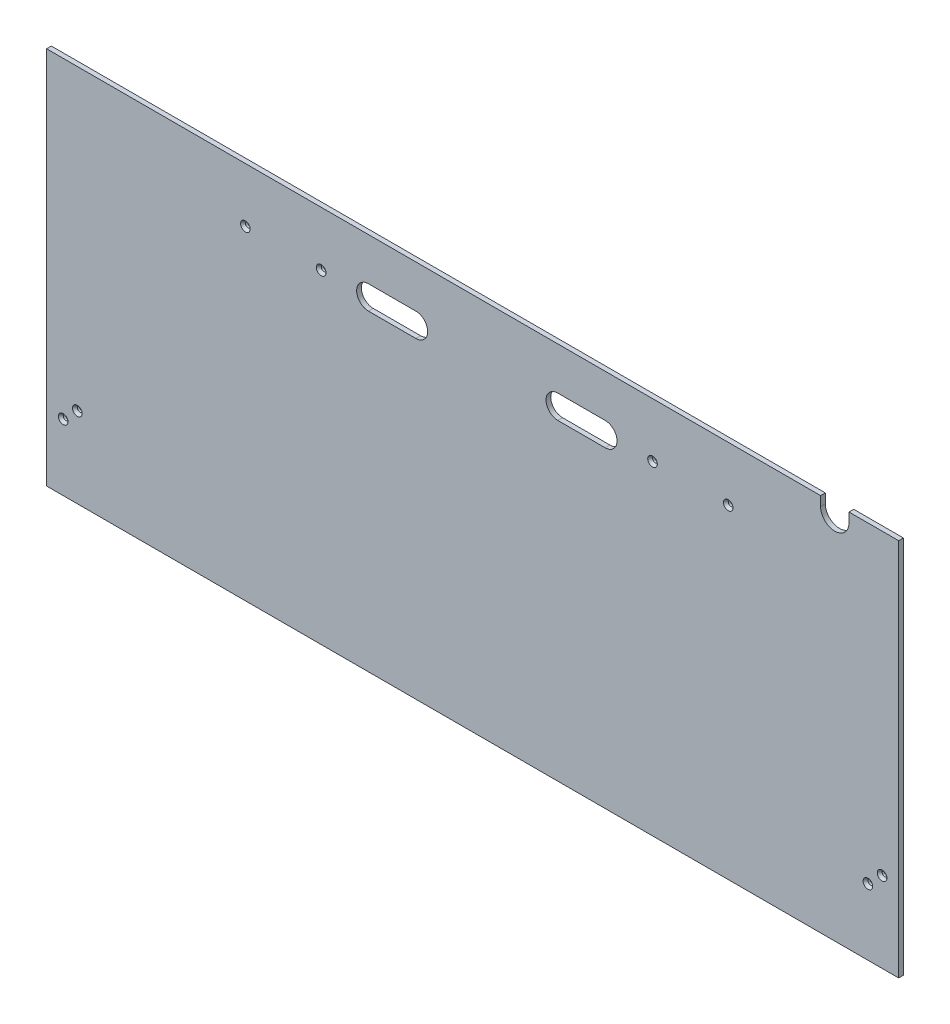
ISO-10303-21;
HEADER;
FILE_DESCRIPTION(('STEP AP214'),'2;1');
FILE_NAME('part.step','',(''),(''),'','','');
FILE_SCHEMA(('AUTOMOTIVE_DESIGN { 1 0 10303 214 1 1 1 1 }'));
ENDSEC;
DATA;
#1=APPLICATION_CONTEXT('core data for automotive mechanical design processes');
#2=APPLICATION_PROTOCOL_DEFINITION('international standard','automotive_design',2000,#1);
#3=PRODUCT_CONTEXT('',#1,'mechanical');
#4=PRODUCT('Part','Part','',(#3));
#5=PRODUCT_RELATED_PRODUCT_CATEGORY('part','',(#4));
#6=PRODUCT_DEFINITION_FORMATION('','',#4);
#7=PRODUCT_DEFINITION_CONTEXT('part definition',#1,'design');
#8=PRODUCT_DEFINITION('design','',#6,#7);
#9=PRODUCT_DEFINITION_SHAPE('','',#8);
#10=(LENGTH_UNIT() NAMED_UNIT(*) SI_UNIT(.MILLI.,.METRE.));
#11=(NAMED_UNIT(*) PLANE_ANGLE_UNIT() SI_UNIT($,.RADIAN.));
#12=(NAMED_UNIT(*) SI_UNIT($,.STERADIAN.) SOLID_ANGLE_UNIT());
#13=UNCERTAINTY_MEASURE_WITH_UNIT(LENGTH_MEASURE(1.E-05),#10,'distance_accuracy_value','');
#14=(GEOMETRIC_REPRESENTATION_CONTEXT(3) GLOBAL_UNCERTAINTY_ASSIGNED_CONTEXT((#13)) GLOBAL_UNIT_ASSIGNED_CONTEXT((#10,
#11,#12)) REPRESENTATION_CONTEXT('',''));
#15=CARTESIAN_POINT('',(0.,0.,0.));
#16=DIRECTION('',(0.,0.,1.));
#17=DIRECTION('',(1.,0.,0.));
#18=AXIS2_PLACEMENT_3D('',#15,#16,#17);
#19=CARTESIAN_POINT('',(0.,508.,6.35));
#20=DIRECTION('',(0.,-1.,0.));
#21=DIRECTION('',(0.,0.,-1.));
#22=AXIS2_PLACEMENT_3D('',#19,#20,#21);
#23=PLANE('',#22);
#24=DIRECTION('',(-1.,0.,0.));
#25=VECTOR('',#24,1.);
#26=CARTESIAN_POINT('',(0.,508.,6.35));
#27=LINE('',#26,#25);
#28=CARTESIAN_POINT('',(1038.225,508.,6.35));
#29=VERTEX_POINT('',#28);
#30=CARTESIAN_POINT('',(0.,508.,6.35));
#31=VERTEX_POINT('',#30);
#32=EDGE_CURVE('E329',#29,#31,#27,.T.);
#33=ORIENTED_EDGE('',*,*,#32,.F.);
#34=DIRECTION('',(0.,0.,1.));
#35=VECTOR('',#34,1.);
#36=CARTESIAN_POINT('',(1038.225,508.,0.));
#37=LINE('',#36,#35);
#38=CARTESIAN_POINT('',(1038.225,508.,0.));
#39=VERTEX_POINT('',#38);
#40=EDGE_CURVE('E180',#39,#29,#37,.T.);
#41=ORIENTED_EDGE('',*,*,#40,.F.);
#42=DIRECTION('',(-1.,0.,0.));
#43=VECTOR('',#42,1.);
#44=CARTESIAN_POINT('',(0.,508.,0.));
#45=LINE('',#44,#43);
#46=CARTESIAN_POINT('',(0.,508.,0.));
#47=VERTEX_POINT('',#46);
#48=EDGE_CURVE('E171',#39,#47,#45,.T.);
#49=ORIENTED_EDGE('',*,*,#48,.T.);
#50=DIRECTION('',(0.,0.,-1.));
#51=VECTOR('',#50,1.);
#52=CARTESIAN_POINT('',(0.,508.,6.35));
#53=LINE('',#52,#51);
#54=EDGE_CURVE('E333',#31,#47,#53,.T.);
#55=ORIENTED_EDGE('',*,*,#54,.F.);
#56=EDGE_LOOP('',(#33,#41,#49,#55));
#57=FACE_BOUND('',#56,.T.);
#58=ADVANCED_FACE('F37',(#57),#23,.F.);
#59=CARTESIAN_POINT('',(0.,0.,6.35));
#60=DIRECTION('',(0.,0.,-1.));
#61=DIRECTION('',(-1.,0.,0.));
#62=AXIS2_PLACEMENT_3D('',#59,#60,#61);
#63=PLANE('',#62);
#64=CARTESIAN_POINT('',(368.3,434.975,6.35));
#65=DIRECTION('',(0.,0.,1.));
#66=DIRECTION('',(1.,0.,0.));
#67=AXIS2_PLACEMENT_3D('',#64,#65,#66);
#68=CIRCLE('',#67,6.43890000000003);
#69=CARTESIAN_POINT('',(374.7389,434.975,6.35));
#70=VERTEX_POINT('',#69);
#71=EDGE_CURVE('E204',#70,#70,#68,.T.);
#72=ORIENTED_EDGE('',*,*,#71,.F.);
#73=EDGE_LOOP('',(#72));
#74=FACE_BOUND('',#73,.T.);
#75=DIRECTION('',(1.,0.,0.));
#76=VECTOR('',#75,1.);
#77=CARTESIAN_POINT('',(431.8,419.1,6.35));
#78=LINE('',#77,#76);
#79=CARTESIAN_POINT('',(431.8,419.1,6.35));
#80=VERTEX_POINT('',#79);
#81=CARTESIAN_POINT('',(495.3,419.1,6.35));
#82=VERTEX_POINT('',#81);
#83=EDGE_CURVE('E274',#80,#82,#78,.T.);
#84=ORIENTED_EDGE('',*,*,#83,.F.);
#85=CARTESIAN_POINT('',(431.8,434.975,6.35));
#86=DIRECTION('',(0.,0.,1.));
#87=DIRECTION('',(1.,0.,0.));
#88=AXIS2_PLACEMENT_3D('',#85,#86,#87);
#89=CIRCLE('',#88,15.875);
#90=CARTESIAN_POINT('',(431.8,450.85,6.35));
#91=VERTEX_POINT('',#90);
#92=EDGE_CURVE('E60',#91,#80,#89,.T.);
#93=ORIENTED_EDGE('',*,*,#92,.F.);
#94=DIRECTION('',(-1.,0.,0.));
#95=VECTOR('',#94,1.);
#96=CARTESIAN_POINT('',(431.8,450.85,6.35));
#97=LINE('',#96,#95);
#98=CARTESIAN_POINT('',(495.3,450.85,6.35));
#99=VERTEX_POINT('',#98);
#100=EDGE_CURVE('E263',#99,#91,#97,.T.);
#101=ORIENTED_EDGE('',*,*,#100,.F.);
#102=CARTESIAN_POINT('',(495.3,434.975,6.35));
#103=DIRECTION('',(0.,0.,1.));
#104=DIRECTION('',(1.,0.,0.));
#105=AXIS2_PLACEMENT_3D('',#102,#103,#104);
#106=CIRCLE('',#105,15.875);
#107=EDGE_CURVE('E278',#82,#99,#106,.T.);
#108=ORIENTED_EDGE('',*,*,#107,.F.);
#109=EDGE_LOOP('',(#84,#93,#101,#108));
#110=FACE_BOUND('',#109,.T.);
#111=DIRECTION('',(1.,0.,0.));
#112=VECTOR('',#111,1.);
#113=CARTESIAN_POINT('',(685.8,419.1,6.35));
#114=LINE('',#113,#112);
#115=CARTESIAN_POINT('',(685.8,419.1,6.35));
#116=VERTEX_POINT('',#115);
#117=CARTESIAN_POINT('',(749.3,419.1,6.35));
#118=VERTEX_POINT('',#117);
#119=EDGE_CURVE('E306',#116,#118,#114,.T.);
#120=ORIENTED_EDGE('',*,*,#119,.F.);
#121=CARTESIAN_POINT('',(685.8,434.975,6.35));
#122=DIRECTION('',(0.,0.,1.));
#123=DIRECTION('',(1.,0.,0.));
#124=AXIS2_PLACEMENT_3D('',#121,#122,#123);
#125=CIRCLE('',#124,15.875);
#126=CARTESIAN_POINT('',(685.8,450.85,6.35));
#127=VERTEX_POINT('',#126);
#128=EDGE_CURVE('E258',#127,#116,#125,.T.);
#129=ORIENTED_EDGE('',*,*,#128,.F.);
#130=DIRECTION('',(-1.,0.,0.));
#131=VECTOR('',#130,1.);
#132=CARTESIAN_POINT('',(685.8,450.85,6.35));
#133=LINE('',#132,#131);
#134=CARTESIAN_POINT('',(749.3,450.85,6.35));
#135=VERTEX_POINT('',#134);
#136=EDGE_CURVE('E295',#135,#127,#133,.T.);
#137=ORIENTED_EDGE('',*,*,#136,.F.);
#138=CARTESIAN_POINT('',(749.3,434.975,6.35));
#139=DIRECTION('',(0.,0.,1.));
#140=DIRECTION('',(1.,0.,0.));
#141=AXIS2_PLACEMENT_3D('',#138,#139,#140);
#142=CIRCLE('',#141,15.875);
#143=EDGE_CURVE('E309',#118,#135,#142,.T.);
#144=ORIENTED_EDGE('',*,*,#143,.F.);
#145=EDGE_LOOP('',(#120,#129,#137,#144));
#146=FACE_BOUND('',#145,.T.);
#147=CARTESIAN_POINT('',(1057.275,495.3,6.35));
#148=DIRECTION('',(0.,0.,1.));
#149=DIRECTION('',(-1.,0.,0.));
#150=AXIS2_PLACEMENT_3D('',#147,#148,#149);
#151=CIRCLE('',#150,19.05);
#152=CARTESIAN_POINT('',(1038.225,495.3,6.35));
#153=VERTEX_POINT('',#152);
#154=CARTESIAN_POINT('',(1076.325,495.3,6.35));
#155=VERTEX_POINT('',#154);
#156=EDGE_CURVE('E174',#153,#155,#151,.T.);
#157=ORIENTED_EDGE('',*,*,#156,.F.);
#158=DIRECTION('',(0.,-1.,0.));
#159=VECTOR('',#158,1.);
#160=CARTESIAN_POINT('',(1038.225,508.,6.35));
#161=LINE('',#160,#159);
#162=EDGE_CURVE('E156',#29,#153,#161,.T.);
#163=ORIENTED_EDGE('',*,*,#162,.F.);
#164=ORIENTED_EDGE('',*,*,#32,.T.);
#165=DIRECTION('',(0.,-1.,0.));
#166=VECTOR('',#165,1.);
#167=CARTESIAN_POINT('',(0.,0.,6.35));
#168=LINE('',#167,#166);
#169=CARTESIAN_POINT('',(0.,0.,6.35));
#170=VERTEX_POINT('',#169);
#171=EDGE_CURVE('E321',#31,#170,#168,.T.);
#172=ORIENTED_EDGE('',*,*,#171,.T.);
#173=DIRECTION('',(1.,0.,0.));
#174=VECTOR('',#173,1.);
#175=CARTESIAN_POINT('',(0.,0.,6.35));
#176=LINE('',#175,#174);
#177=CARTESIAN_POINT('',(1143.,0.,6.35));
#178=VERTEX_POINT('',#177);
#179=EDGE_CURVE('E324',#170,#178,#176,.T.);
#180=ORIENTED_EDGE('',*,*,#179,.T.);
#181=DIRECTION('',(0.,1.,0.));
#182=VECTOR('',#181,1.);
#183=CARTESIAN_POINT('',(1143.,0.,6.35));
#184=LINE('',#183,#182);
#185=CARTESIAN_POINT('',(1143.,508.,6.35));
#186=VERTEX_POINT('',#185);
#187=EDGE_CURVE('E327',#178,#186,#184,.T.);
#188=ORIENTED_EDGE('',*,*,#187,.T.);
#189=CARTESIAN_POINT('',(1076.325,508.,6.35));
#190=VERTEX_POINT('',#189);
#191=EDGE_CURVE('E330',#186,#190,#27,.T.);
#192=ORIENTED_EDGE('',*,*,#191,.T.);
#193=DIRECTION('',(0.,1.,0.));
#194=VECTOR('',#193,1.);
#195=CARTESIAN_POINT('',(1076.325,508.,6.35));
#196=LINE('',#195,#194);
#197=EDGE_CURVE('E172',#155,#190,#196,.T.);
#198=ORIENTED_EDGE('',*,*,#197,.F.);
#199=EDGE_LOOP('',(#157,#163,#164,#172,#180,#188,#192,#198));
#200=FACE_BOUND('',#199,.T.);
#201=CARTESIAN_POINT('',(22.2249999999999,88.9,6.35));
#202=DIRECTION('',(0.,0.,1.));
#203=DIRECTION('',(1.,0.,0.));
#204=AXIS2_PLACEMENT_3D('',#201,#202,#203);
#205=CIRCLE('',#204,6.4389);
#206=CARTESIAN_POINT('',(28.6638999999999,88.9,6.35));
#207=VERTEX_POINT('',#206);
#208=EDGE_CURVE('E249',#207,#207,#205,.T.);
#209=ORIENTED_EDGE('',*,*,#208,.F.);
#210=EDGE_LOOP('',(#209));
#211=FACE_BOUND('',#210,.T.);
#212=CARTESIAN_POINT('',(41.2749999999999,107.95,6.35));
#213=DIRECTION('',(0.,0.,1.));
#214=DIRECTION('',(1.,0.,0.));
#215=AXIS2_PLACEMENT_3D('',#212,#213,#214);
#216=CIRCLE('',#215,6.4389);
#217=CARTESIAN_POINT('',(47.7138999999999,107.95,6.35));
#218=VERTEX_POINT('',#217);
#219=EDGE_CURVE('E240',#218,#218,#216,.T.);
#220=ORIENTED_EDGE('',*,*,#219,.F.);
#221=EDGE_LOOP('',(#220));
#222=FACE_BOUND('',#221,.T.);
#223=CARTESIAN_POINT('',(1101.725,88.9,6.35));
#224=DIRECTION('',(0.,0.,1.));
#225=DIRECTION('',(1.,0.,0.));
#226=AXIS2_PLACEMENT_3D('',#223,#224,#225);
#227=CIRCLE('',#226,6.43890000000003);
#228=CARTESIAN_POINT('',(1108.1639,88.9,6.35));
#229=VERTEX_POINT('',#228);
#230=EDGE_CURVE('E231',#229,#229,#227,.T.);
#231=ORIENTED_EDGE('',*,*,#230,.F.);
#232=EDGE_LOOP('',(#231));
#233=FACE_BOUND('',#232,.T.);
#234=CARTESIAN_POINT('',(1120.775,107.95,6.35));
#235=DIRECTION('',(0.,0.,1.));
#236=DIRECTION('',(1.,0.,0.));
#237=AXIS2_PLACEMENT_3D('',#234,#235,#236);
#238=CIRCLE('',#237,6.43890000000003);
#239=CARTESIAN_POINT('',(1127.2139,107.95,6.35));
#240=VERTEX_POINT('',#239);
#241=EDGE_CURVE('E222',#240,#240,#238,.T.);
#242=ORIENTED_EDGE('',*,*,#241,.F.);
#243=EDGE_LOOP('',(#242));
#244=FACE_BOUND('',#243,.T.);
#245=CARTESIAN_POINT('',(266.7,434.975,6.35));
#246=DIRECTION('',(0.,0.,1.));
#247=DIRECTION('',(1.,0.,0.));
#248=AXIS2_PLACEMENT_3D('',#245,#246,#247);
#249=CIRCLE('',#248,6.43890000000003);
#250=CARTESIAN_POINT('',(273.1389,434.975,6.35));
#251=VERTEX_POINT('',#250);
#252=EDGE_CURVE('E213',#251,#251,#249,.T.);
#253=ORIENTED_EDGE('',*,*,#252,.F.);
#254=EDGE_LOOP('',(#253));
#255=FACE_BOUND('',#254,.T.);
#256=CARTESIAN_POINT('',(812.8,434.975,6.35));
#257=DIRECTION('',(0.,0.,1.));
#258=DIRECTION('',(1.,0.,0.));
#259=AXIS2_PLACEMENT_3D('',#256,#257,#258);
#260=CIRCLE('',#259,6.43890000000003);
#261=CARTESIAN_POINT('',(819.2389,434.975,6.35));
#262=VERTEX_POINT('',#261);
#263=EDGE_CURVE('E195',#262,#262,#260,.T.);
#264=ORIENTED_EDGE('',*,*,#263,.F.);
#265=EDGE_LOOP('',(#264));
#266=FACE_BOUND('',#265,.T.);
#267=CARTESIAN_POINT('',(914.4,434.975,6.35));
#268=DIRECTION('',(0.,0.,1.));
#269=DIRECTION('',(1.,0.,0.));
#270=AXIS2_PLACEMENT_3D('',#267,#268,#269);
#271=CIRCLE('',#270,6.43890000000003);
#272=CARTESIAN_POINT('',(920.8389,434.975,6.35));
#273=VERTEX_POINT('',#272);
#274=EDGE_CURVE('E182',#273,#273,#271,.T.);
#275=ORIENTED_EDGE('',*,*,#274,.F.);
#276=EDGE_LOOP('',(#275));
#277=FACE_BOUND('',#276,.T.);
#278=ADVANCED_FACE('F360',(#74,#110,#146,#200,#211,#222,#233,#244,#255,#266,#277),#63,.F.);
#279=CARTESIAN_POINT('',(0.,0.,6.35));
#280=DIRECTION('',(1.,0.,0.));
#281=DIRECTION('',(0.,0.,-1.));
#282=AXIS2_PLACEMENT_3D('',#279,#280,#281);
#283=PLANE('',#282);
#284=DIRECTION('',(0.,-1.,0.));
#285=VECTOR('',#284,1.);
#286=CARTESIAN_POINT('',(0.,0.,0.));
#287=LINE('',#286,#285);
#288=CARTESIAN_POINT('',(0.,0.,0.));
#289=VERTEX_POINT('',#288);
#290=EDGE_CURVE('E285',#47,#289,#287,.T.);
#291=ORIENTED_EDGE('',*,*,#290,.T.);
#292=DIRECTION('',(0.,0.,-1.));
#293=VECTOR('',#292,1.);
#294=CARTESIAN_POINT('',(0.,0.,6.35));
#295=LINE('',#294,#293);
#296=EDGE_CURVE('E11',#170,#289,#295,.T.);
#297=ORIENTED_EDGE('',*,*,#296,.F.);
#298=ORIENTED_EDGE('',*,*,#171,.F.);
#299=ORIENTED_EDGE('',*,*,#54,.T.);
#300=EDGE_LOOP('',(#291,#297,#298,#299));
#301=FACE_BOUND('',#300,.T.);
#302=ADVANCED_FACE('F39',(#301),#283,.F.);
#303=CARTESIAN_POINT('',(0.,0.,6.35));
#304=DIRECTION('',(0.,1.,0.));
#305=DIRECTION('',(0.,0.,1.));
#306=AXIS2_PLACEMENT_3D('',#303,#304,#305);
#307=PLANE('',#306);
#308=DIRECTION('',(1.,0.,0.));
#309=VECTOR('',#308,1.);
#310=CARTESIAN_POINT('',(0.,0.,0.));
#311=LINE('',#310,#309);
#312=CARTESIAN_POINT('',(1143.,0.,0.));
#313=VERTEX_POINT('',#312);
#314=EDGE_CURVE('E336',#289,#313,#311,.T.);
#315=ORIENTED_EDGE('',*,*,#314,.T.);
#316=DIRECTION('',(0.,0.,-1.));
#317=VECTOR('',#316,1.);
#318=CARTESIAN_POINT('',(1143.,0.,6.35));
#319=LINE('',#318,#317);
#320=EDGE_CURVE('E45',#178,#313,#319,.T.);
#321=ORIENTED_EDGE('',*,*,#320,.F.);
#322=ORIENTED_EDGE('',*,*,#179,.F.);
#323=ORIENTED_EDGE('',*,*,#296,.T.);
#324=EDGE_LOOP('',(#315,#321,#322,#323));
#325=FACE_BOUND('',#324,.T.);
#326=ADVANCED_FACE('F364',(#325),#307,.F.);
#327=CARTESIAN_POINT('',(1143.,0.,6.35));
#328=DIRECTION('',(-1.,0.,0.));
#329=DIRECTION('',(0.,0.,1.));
#330=AXIS2_PLACEMENT_3D('',#327,#328,#329);
#331=PLANE('',#330);
#332=DIRECTION('',(0.,1.,0.));
#333=VECTOR('',#332,1.);
#334=CARTESIAN_POINT('',(1143.,0.,0.));
#335=LINE('',#334,#333);
#336=CARTESIAN_POINT('',(1143.,508.,0.));
#337=VERTEX_POINT('',#336);
#338=EDGE_CURVE('E338',#313,#337,#335,.T.);
#339=ORIENTED_EDGE('',*,*,#338,.T.);
#340=DIRECTION('',(0.,0.,-1.));
#341=VECTOR('',#340,1.);
#342=CARTESIAN_POINT('',(1143.,508.,6.35));
#343=LINE('',#342,#341);
#344=EDGE_CURVE('E344',#186,#337,#343,.T.);
#345=ORIENTED_EDGE('',*,*,#344,.F.);
#346=ORIENTED_EDGE('',*,*,#187,.F.);
#347=ORIENTED_EDGE('',*,*,#320,.T.);
#348=EDGE_LOOP('',(#339,#345,#346,#347));
#349=FACE_BOUND('',#348,.T.);
#350=ADVANCED_FACE('F351',(#349),#331,.F.);
#351=CARTESIAN_POINT('',(1076.325,508.,0.));
#352=VERTEX_POINT('',#351);
#353=EDGE_CURVE('E325',#337,#352,#45,.T.);
#354=ORIENTED_EDGE('',*,*,#353,.T.);
#355=DIRECTION('',(0.,0.,1.));
#356=VECTOR('',#355,1.);
#357=CARTESIAN_POINT('',(1076.325,508.,0.));
#358=LINE('',#357,#356);
#359=EDGE_CURVE('E183',#352,#190,#358,.T.);
#360=ORIENTED_EDGE('',*,*,#359,.T.);
#361=ORIENTED_EDGE('',*,*,#191,.F.);
#362=ORIENTED_EDGE('',*,*,#344,.T.);
#363=EDGE_LOOP('',(#354,#360,#361,#362));
#364=FACE_BOUND('',#363,.T.);
#365=ADVANCED_FACE('F356',(#364),#23,.F.);
#366=CARTESIAN_POINT('',(0.,0.,0.));
#367=DIRECTION('',(0.,0.,-1.));
#368=DIRECTION('',(-1.,0.,0.));
#369=AXIS2_PLACEMENT_3D('',#366,#367,#368);
#370=PLANE('',#369);
#371=DIRECTION('',(0.,-1.,0.));
#372=VECTOR('',#371,1.);
#373=CARTESIAN_POINT('',(1038.225,508.,0.));
#374=LINE('',#373,#372);
#375=CARTESIAN_POINT('',(1038.225,495.3,0.));
#376=VERTEX_POINT('',#375);
#377=EDGE_CURVE('E153',#39,#376,#374,.T.);
#378=ORIENTED_EDGE('',*,*,#377,.T.);
#379=CARTESIAN_POINT('',(1057.275,495.3,0.));
#380=DIRECTION('',(0.,0.,1.));
#381=DIRECTION('',(-1.,0.,0.));
#382=AXIS2_PLACEMENT_3D('',#379,#380,#381);
#383=CIRCLE('',#382,19.05);
#384=CARTESIAN_POINT('',(1076.325,495.3,0.));
#385=VERTEX_POINT('',#384);
#386=EDGE_CURVE('E163',#376,#385,#383,.T.);
#387=ORIENTED_EDGE('',*,*,#386,.T.);
#388=DIRECTION('',(0.,1.,0.));
#389=VECTOR('',#388,1.);
#390=CARTESIAN_POINT('',(1076.325,508.,0.));
#391=LINE('',#390,#389);
#392=EDGE_CURVE('E52',#385,#352,#391,.T.);
#393=ORIENTED_EDGE('',*,*,#392,.T.);
#394=ORIENTED_EDGE('',*,*,#353,.F.);
#395=ORIENTED_EDGE('',*,*,#338,.F.);
#396=ORIENTED_EDGE('',*,*,#314,.F.);
#397=ORIENTED_EDGE('',*,*,#290,.F.);
#398=ORIENTED_EDGE('',*,*,#48,.F.);
#399=EDGE_LOOP('',(#378,#387,#393,#394,#395,#396,#397,#398));
#400=FACE_BOUND('',#399,.T.);
#401=CARTESIAN_POINT('',(914.4,434.975,0.));
#402=DIRECTION('',(0.,0.,-1.));
#403=DIRECTION('',(-1.,0.,0.));
#404=AXIS2_PLACEMENT_3D('',#401,#402,#403);
#405=CIRCLE('',#404,3.3782);
#406=CARTESIAN_POINT('',(911.0218,434.975,0.));
#407=VERTEX_POINT('',#406);
#408=EDGE_CURVE('E192',#407,#407,#405,.T.);
#409=ORIENTED_EDGE('',*,*,#408,.F.);
#410=EDGE_LOOP('',(#409));
#411=FACE_BOUND('',#410,.T.);
#412=CARTESIAN_POINT('',(812.8,434.975,0.));
#413=DIRECTION('',(0.,0.,-1.));
#414=DIRECTION('',(-1.,0.,0.));
#415=AXIS2_PLACEMENT_3D('',#412,#413,#414);
#416=CIRCLE('',#415,3.3782);
#417=CARTESIAN_POINT('',(809.4218,434.975,0.));
#418=VERTEX_POINT('',#417);
#419=EDGE_CURVE('E201',#418,#418,#416,.T.);
#420=ORIENTED_EDGE('',*,*,#419,.F.);
#421=EDGE_LOOP('',(#420));
#422=FACE_BOUND('',#421,.T.);
#423=CARTESIAN_POINT('',(368.3,434.975,0.));
#424=DIRECTION('',(0.,0.,-1.));
#425=DIRECTION('',(-1.,0.,0.));
#426=AXIS2_PLACEMENT_3D('',#423,#424,#425);
#427=CIRCLE('',#426,3.3782);
#428=CARTESIAN_POINT('',(364.9218,434.975,0.));
#429=VERTEX_POINT('',#428);
#430=EDGE_CURVE('E210',#429,#429,#427,.T.);
#431=ORIENTED_EDGE('',*,*,#430,.F.);
#432=EDGE_LOOP('',(#431));
#433=FACE_BOUND('',#432,.T.);
#434=CARTESIAN_POINT('',(266.7,434.975,0.));
#435=DIRECTION('',(0.,0.,-1.));
#436=DIRECTION('',(-1.,0.,0.));
#437=AXIS2_PLACEMENT_3D('',#434,#435,#436);
#438=CIRCLE('',#437,3.3782);
#439=CARTESIAN_POINT('',(263.3218,434.975,0.));
#440=VERTEX_POINT('',#439);
#441=EDGE_CURVE('E219',#440,#440,#438,.T.);
#442=ORIENTED_EDGE('',*,*,#441,.F.);
#443=EDGE_LOOP('',(#442));
#444=FACE_BOUND('',#443,.T.);
#445=CARTESIAN_POINT('',(1120.775,107.95,0.));
#446=DIRECTION('',(0.,0.,-1.));
#447=DIRECTION('',(-1.,0.,0.));
#448=AXIS2_PLACEMENT_3D('',#445,#446,#447);
#449=CIRCLE('',#448,3.3782);
#450=CARTESIAN_POINT('',(1117.3968,107.95,0.));
#451=VERTEX_POINT('',#450);
#452=EDGE_CURVE('E228',#451,#451,#449,.T.);
#453=ORIENTED_EDGE('',*,*,#452,.F.);
#454=EDGE_LOOP('',(#453));
#455=FACE_BOUND('',#454,.T.);
#456=CARTESIAN_POINT('',(1101.725,88.9,0.));
#457=DIRECTION('',(0.,0.,-1.));
#458=DIRECTION('',(-1.,0.,0.));
#459=AXIS2_PLACEMENT_3D('',#456,#457,#458);
#460=CIRCLE('',#459,3.3782);
#461=CARTESIAN_POINT('',(1098.3468,88.9,0.));
#462=VERTEX_POINT('',#461);
#463=EDGE_CURVE('E237',#462,#462,#460,.T.);
#464=ORIENTED_EDGE('',*,*,#463,.F.);
#465=EDGE_LOOP('',(#464));
#466=FACE_BOUND('',#465,.T.);
#467=CARTESIAN_POINT('',(41.2749999999999,107.95,0.));
#468=DIRECTION('',(0.,0.,-1.));
#469=DIRECTION('',(-1.,0.,0.));
#470=AXIS2_PLACEMENT_3D('',#467,#468,#469);
#471=CIRCLE('',#470,3.3782);
#472=CARTESIAN_POINT('',(37.8968,107.95,0.));
#473=VERTEX_POINT('',#472);
#474=EDGE_CURVE('E246',#473,#473,#471,.T.);
#475=ORIENTED_EDGE('',*,*,#474,.F.);
#476=EDGE_LOOP('',(#475));
#477=FACE_BOUND('',#476,.T.);
#478=CARTESIAN_POINT('',(22.2249999999999,88.9,0.));
#479=DIRECTION('',(0.,0.,-1.));
#480=DIRECTION('',(-1.,0.,0.));
#481=AXIS2_PLACEMENT_3D('',#478,#479,#480);
#482=CIRCLE('',#481,3.3782);
#483=CARTESIAN_POINT('',(18.8467999999999,88.9,0.));
#484=VERTEX_POINT('',#483);
#485=EDGE_CURVE('E255',#484,#484,#482,.T.);
#486=ORIENTED_EDGE('',*,*,#485,.F.);
#487=EDGE_LOOP('',(#486));
#488=FACE_BOUND('',#487,.T.);
#489=CARTESIAN_POINT('',(431.8,434.975,0.));
#490=DIRECTION('',(0.,0.,1.));
#491=DIRECTION('',(1.,0.,0.));
#492=AXIS2_PLACEMENT_3D('',#489,#490,#491);
#493=CIRCLE('',#492,15.875);
#494=CARTESIAN_POINT('',(431.8,450.85,0.));
#495=VERTEX_POINT('',#494);
#496=CARTESIAN_POINT('',(431.8,419.1,0.));
#497=VERTEX_POINT('',#496);
#498=EDGE_CURVE('E259',#495,#497,#493,.T.);
#499=ORIENTED_EDGE('',*,*,#498,.T.);
#500=DIRECTION('',(1.,0.,0.));
#501=VECTOR('',#500,1.);
#502=CARTESIAN_POINT('',(431.8,419.1,0.));
#503=LINE('',#502,#501);
#504=CARTESIAN_POINT('',(495.3,419.1,0.));
#505=VERTEX_POINT('',#504);
#506=EDGE_CURVE('E262',#497,#505,#503,.T.);
#507=ORIENTED_EDGE('',*,*,#506,.T.);
#508=CARTESIAN_POINT('',(495.3,434.975,0.));
#509=DIRECTION('',(0.,0.,1.));
#510=DIRECTION('',(1.,0.,0.));
#511=AXIS2_PLACEMENT_3D('',#508,#509,#510);
#512=CIRCLE('',#511,15.875);
#513=CARTESIAN_POINT('',(495.3,450.85,0.));
#514=VERTEX_POINT('',#513);
#515=EDGE_CURVE('E266',#505,#514,#512,.T.);
#516=ORIENTED_EDGE('',*,*,#515,.T.);
#517=DIRECTION('',(-1.,0.,0.));
#518=VECTOR('',#517,1.);
#519=CARTESIAN_POINT('',(431.8,450.85,0.));
#520=LINE('',#519,#518);
#521=EDGE_CURVE('E269',#514,#495,#520,.T.);
#522=ORIENTED_EDGE('',*,*,#521,.T.);
#523=EDGE_LOOP('',(#499,#507,#516,#522));
#524=FACE_BOUND('',#523,.T.);
#525=CARTESIAN_POINT('',(685.8,434.975,0.));
#526=DIRECTION('',(0.,0.,1.));
#527=DIRECTION('',(1.,0.,0.));
#528=AXIS2_PLACEMENT_3D('',#525,#526,#527);
#529=CIRCLE('',#528,15.875);
#530=CARTESIAN_POINT('',(685.8,450.85,0.));
#531=VERTEX_POINT('',#530);
#532=CARTESIAN_POINT('',(685.8,419.1,0.));
#533=VERTEX_POINT('',#532);
#534=EDGE_CURVE('E291',#531,#533,#529,.T.);
#535=ORIENTED_EDGE('',*,*,#534,.T.);
#536=DIRECTION('',(1.,0.,0.));
#537=VECTOR('',#536,1.);
#538=CARTESIAN_POINT('',(685.8,419.1,0.));
#539=LINE('',#538,#537);
#540=CARTESIAN_POINT('',(749.3,419.1,0.));
#541=VERTEX_POINT('',#540);
#542=EDGE_CURVE('E294',#533,#541,#539,.T.);
#543=ORIENTED_EDGE('',*,*,#542,.T.);
#544=CARTESIAN_POINT('',(749.3,434.975,0.));
#545=DIRECTION('',(0.,0.,1.));
#546=DIRECTION('',(1.,0.,0.));
#547=AXIS2_PLACEMENT_3D('',#544,#545,#546);
#548=CIRCLE('',#547,15.875);
#549=CARTESIAN_POINT('',(749.3,450.85,0.));
#550=VERTEX_POINT('',#549);
#551=EDGE_CURVE('E298',#541,#550,#548,.T.);
#552=ORIENTED_EDGE('',*,*,#551,.T.);
#553=DIRECTION('',(-1.,0.,0.));
#554=VECTOR('',#553,1.);
#555=CARTESIAN_POINT('',(685.8,450.85,0.));
#556=LINE('',#555,#554);
#557=EDGE_CURVE('E301',#550,#531,#556,.T.);
#558=ORIENTED_EDGE('',*,*,#557,.T.);
#559=EDGE_LOOP('',(#535,#543,#552,#558));
#560=FACE_BOUND('',#559,.T.);
#561=ADVANCED_FACE('F168',(#400,#411,#422,#433,#444,#455,#466,#477,#488,#524,#560),#370,.T.);
#562=CARTESIAN_POINT('',(685.8,434.975,0.));
#563=DIRECTION('',(0.,0.,1.));
#564=DIRECTION('',(1.,0.,0.));
#565=AXIS2_PLACEMENT_3D('',#562,#563,#564);
#566=CYLINDRICAL_SURFACE('',#565,15.875);
#567=ORIENTED_EDGE('',*,*,#128,.T.);
#568=DIRECTION('',(0.,0.,1.));
#569=VECTOR('',#568,1.);
#570=CARTESIAN_POINT('',(685.8,419.1,0.));
#571=LINE('',#570,#569);
#572=EDGE_CURVE('E304',#533,#116,#571,.T.);
#573=ORIENTED_EDGE('',*,*,#572,.F.);
#574=ORIENTED_EDGE('',*,*,#534,.F.);
#575=DIRECTION('',(0.,0.,1.));
#576=VECTOR('',#575,1.);
#577=CARTESIAN_POINT('',(685.8,450.85,0.));
#578=LINE('',#577,#576);
#579=EDGE_CURVE('E275',#531,#127,#578,.T.);
#580=ORIENTED_EDGE('',*,*,#579,.T.);
#581=EDGE_LOOP('',(#567,#573,#574,#580));
#582=FACE_BOUND('',#581,.T.);
#583=ADVANCED_FACE('F383',(#582),#566,.F.);
#584=CARTESIAN_POINT('',(685.8,450.85,0.));
#585=DIRECTION('',(0.,1.,0.));
#586=DIRECTION('',(0.,0.,1.));
#587=AXIS2_PLACEMENT_3D('',#584,#585,#586);
#588=PLANE('',#587);
#589=ORIENTED_EDGE('',*,*,#136,.T.);
#590=ORIENTED_EDGE('',*,*,#579,.F.);
#591=ORIENTED_EDGE('',*,*,#557,.F.);
#592=DIRECTION('',(0.,0.,1.));
#593=VECTOR('',#592,1.);
#594=CARTESIAN_POINT('',(749.3,450.85,0.));
#595=LINE('',#594,#593);
#596=EDGE_CURVE('E315',#550,#135,#595,.T.);
#597=ORIENTED_EDGE('',*,*,#596,.T.);
#598=EDGE_LOOP('',(#589,#590,#591,#597));
#599=FACE_BOUND('',#598,.T.);
#600=ADVANCED_FACE('F411',(#599),#588,.F.);
#601=CARTESIAN_POINT('',(749.3,434.975,0.));
#602=DIRECTION('',(0.,0.,1.));
#603=DIRECTION('',(1.,0.,0.));
#604=AXIS2_PLACEMENT_3D('',#601,#602,#603);
#605=CYLINDRICAL_SURFACE('',#604,15.875);
#606=ORIENTED_EDGE('',*,*,#143,.T.);
#607=ORIENTED_EDGE('',*,*,#596,.F.);
#608=ORIENTED_EDGE('',*,*,#551,.F.);
#609=DIRECTION('',(0.,0.,1.));
#610=VECTOR('',#609,1.);
#611=CARTESIAN_POINT('',(749.3,419.1,0.));
#612=LINE('',#611,#610);
#613=EDGE_CURVE('E317',#541,#118,#612,.T.);
#614=ORIENTED_EDGE('',*,*,#613,.T.);
#615=EDGE_LOOP('',(#606,#607,#608,#614));
#616=FACE_BOUND('',#615,.T.);
#617=ADVANCED_FACE('F419',(#616),#605,.F.);
#618=CARTESIAN_POINT('',(685.8,419.1,0.));
#619=DIRECTION('',(0.,-1.,0.));
#620=DIRECTION('',(0.,0.,-1.));
#621=AXIS2_PLACEMENT_3D('',#618,#619,#620);
#622=PLANE('',#621);
#623=ORIENTED_EDGE('',*,*,#119,.T.);
#624=ORIENTED_EDGE('',*,*,#613,.F.);
#625=ORIENTED_EDGE('',*,*,#542,.F.);
#626=ORIENTED_EDGE('',*,*,#572,.T.);
#627=EDGE_LOOP('',(#623,#624,#625,#626));
#628=FACE_BOUND('',#627,.T.);
#629=ADVANCED_FACE('F427',(#628),#622,.F.);
#630=CARTESIAN_POINT('',(431.8,434.975,0.));
#631=DIRECTION('',(0.,0.,1.));
#632=DIRECTION('',(1.,0.,0.));
#633=AXIS2_PLACEMENT_3D('',#630,#631,#632);
#634=CYLINDRICAL_SURFACE('',#633,15.875);
#635=ORIENTED_EDGE('',*,*,#92,.T.);
#636=DIRECTION('',(0.,0.,1.));
#637=VECTOR('',#636,1.);
#638=CARTESIAN_POINT('',(431.8,419.1,0.));
#639=LINE('',#638,#637);
#640=EDGE_CURVE('E272',#497,#80,#639,.T.);
#641=ORIENTED_EDGE('',*,*,#640,.F.);
#642=ORIENTED_EDGE('',*,*,#498,.F.);
#643=DIRECTION('',(0.,0.,1.));
#644=VECTOR('',#643,1.);
#645=CARTESIAN_POINT('',(431.8,450.85,0.));
#646=LINE('',#645,#644);
#647=EDGE_CURVE('E283',#495,#91,#646,.T.);
#648=ORIENTED_EDGE('',*,*,#647,.T.);
#649=EDGE_LOOP('',(#635,#641,#642,#648));
#650=FACE_BOUND('',#649,.T.);
#651=ADVANCED_FACE('F435',(#650),#634,.F.);
#652=CARTESIAN_POINT('',(431.8,450.85,0.));
#653=DIRECTION('',(0.,1.,0.));
#654=DIRECTION('',(0.,0.,1.));
#655=AXIS2_PLACEMENT_3D('',#652,#653,#654);
#656=PLANE('',#655);
#657=ORIENTED_EDGE('',*,*,#100,.T.);
#658=ORIENTED_EDGE('',*,*,#647,.F.);
#659=ORIENTED_EDGE('',*,*,#521,.F.);
#660=DIRECTION('',(0.,0.,1.));
#661=VECTOR('',#660,1.);
#662=CARTESIAN_POINT('',(495.3,450.85,0.));
#663=LINE('',#662,#661);
#664=EDGE_CURVE('E286',#514,#99,#663,.T.);
#665=ORIENTED_EDGE('',*,*,#664,.T.);
#666=EDGE_LOOP('',(#657,#658,#659,#665));
#667=FACE_BOUND('',#666,.T.);
#668=ADVANCED_FACE('F443',(#667),#656,.F.);
#669=CARTESIAN_POINT('',(495.3,434.975,0.));
#670=DIRECTION('',(0.,0.,1.));
#671=DIRECTION('',(1.,0.,0.));
#672=AXIS2_PLACEMENT_3D('',#669,#670,#671);
#673=CYLINDRICAL_SURFACE('',#672,15.875);
#674=ORIENTED_EDGE('',*,*,#107,.T.);
#675=ORIENTED_EDGE('',*,*,#664,.F.);
#676=ORIENTED_EDGE('',*,*,#515,.F.);
#677=DIRECTION('',(0.,0.,1.));
#678=VECTOR('',#677,1.);
#679=CARTESIAN_POINT('',(495.3,419.1,0.));
#680=LINE('',#679,#678);
#681=EDGE_CURVE('E288',#505,#82,#680,.T.);
#682=ORIENTED_EDGE('',*,*,#681,.T.);
#683=EDGE_LOOP('',(#674,#675,#676,#682));
#684=FACE_BOUND('',#683,.T.);
#685=ADVANCED_FACE('F450',(#684),#673,.F.);
#686=CARTESIAN_POINT('',(431.8,419.1,0.));
#687=DIRECTION('',(0.,-1.,0.));
#688=DIRECTION('',(0.,0.,-1.));
#689=AXIS2_PLACEMENT_3D('',#686,#687,#688);
#690=PLANE('',#689);
#691=ORIENTED_EDGE('',*,*,#83,.T.);
#692=ORIENTED_EDGE('',*,*,#681,.F.);
#693=ORIENTED_EDGE('',*,*,#506,.F.);
#694=ORIENTED_EDGE('',*,*,#640,.T.);
#695=EDGE_LOOP('',(#691,#692,#693,#694));
#696=FACE_BOUND('',#695,.T.);
#697=ADVANCED_FACE('F458',(#696),#690,.F.);
#698=CARTESIAN_POINT('',(22.2249999999999,88.9,6.35));
#699=DIRECTION('',(0.,0.,1.));
#700=DIRECTION('',(1.,0.,0.));
#701=AXIS2_PLACEMENT_3D('',#698,#699,#700);
#702=CYLINDRICAL_SURFACE('',#701,3.3782);
#703=CARTESIAN_POINT('',(22.2249999999999,88.9,2.82906741601866));
#704=DIRECTION('',(0.,0.,1.));
#705=DIRECTION('',(1.,0.,0.));
#706=AXIS2_PLACEMENT_3D('',#703,#704,#705);
#707=CIRCLE('',#706,3.3782);
#708=CARTESIAN_POINT('',(25.6031999999999,88.9,2.82906741601866));
#709=VERTEX_POINT('',#708);
#710=EDGE_CURVE('E252',#709,#709,#707,.T.);
#711=ORIENTED_EDGE('',*,*,#710,.T.);
#712=EDGE_LOOP('',(#711));
#713=FACE_BOUND('',#712,.T.);
#714=ORIENTED_EDGE('',*,*,#485,.T.);
#715=EDGE_LOOP('',(#714));
#716=FACE_BOUND('',#715,.T.);
#717=ADVANCED_FACE('F466',(#713,#716),#702,.F.);
#718=CARTESIAN_POINT('',(22.2249999999999,88.9,6.35));
#719=DIRECTION('',(0.,0.,1.));
#720=DIRECTION('',(1.,0.,0.));
#721=AXIS2_PLACEMENT_3D('',#718,#719,#720);
#722=CONICAL_SURFACE('',#721,6.4389,0.715584993317677);
#723=ORIENTED_EDGE('',*,*,#710,.F.);
#724=EDGE_LOOP('',(#723));
#725=FACE_BOUND('',#724,.T.);
#726=ORIENTED_EDGE('',*,*,#208,.T.);
#727=EDGE_LOOP('',(#726));
#728=FACE_BOUND('',#727,.T.);
#729=ADVANCED_FACE('F478',(#725,#728),#722,.F.);
#730=CARTESIAN_POINT('',(41.2749999999999,107.95,6.35));
#731=DIRECTION('',(0.,0.,1.));
#732=DIRECTION('',(1.,0.,0.));
#733=AXIS2_PLACEMENT_3D('',#730,#731,#732);
#734=CYLINDRICAL_SURFACE('',#733,3.3782);
#735=CARTESIAN_POINT('',(41.2749999999999,107.95,2.82906741601866));
#736=DIRECTION('',(0.,0.,1.));
#737=DIRECTION('',(1.,0.,0.));
#738=AXIS2_PLACEMENT_3D('',#735,#736,#737);
#739=CIRCLE('',#738,3.3782);
#740=CARTESIAN_POINT('',(44.6531999999999,107.95,2.82906741601866));
#741=VERTEX_POINT('',#740);
#742=EDGE_CURVE('E243',#741,#741,#739,.T.);
#743=ORIENTED_EDGE('',*,*,#742,.T.);
#744=EDGE_LOOP('',(#743));
#745=FACE_BOUND('',#744,.T.);
#746=ORIENTED_EDGE('',*,*,#474,.T.);
#747=EDGE_LOOP('',(#746));
#748=FACE_BOUND('',#747,.T.);
#749=ADVANCED_FACE('F486',(#745,#748),#734,.F.);
#750=CARTESIAN_POINT('',(41.2749999999999,107.95,6.35));
#751=DIRECTION('',(0.,0.,1.));
#752=DIRECTION('',(1.,0.,0.));
#753=AXIS2_PLACEMENT_3D('',#750,#751,#752);
#754=CONICAL_SURFACE('',#753,6.4389,0.715584993317676);
#755=ORIENTED_EDGE('',*,*,#742,.F.);
#756=EDGE_LOOP('',(#755));
#757=FACE_BOUND('',#756,.T.);
#758=ORIENTED_EDGE('',*,*,#219,.T.);
#759=EDGE_LOOP('',(#758));
#760=FACE_BOUND('',#759,.T.);
#761=ADVANCED_FACE('F494',(#757,#760),#754,.F.);
#762=CARTESIAN_POINT('',(1101.725,88.9,6.35));
#763=DIRECTION('',(0.,0.,1.));
#764=DIRECTION('',(1.,0.,0.));
#765=AXIS2_PLACEMENT_3D('',#762,#763,#764);
#766=CYLINDRICAL_SURFACE('',#765,3.3782);
#767=CARTESIAN_POINT('',(1101.725,88.9,2.82906741601866));
#768=DIRECTION('',(0.,0.,1.));
#769=DIRECTION('',(1.,0.,0.));
#770=AXIS2_PLACEMENT_3D('',#767,#768,#769);
#771=CIRCLE('',#770,3.3782);
#772=CARTESIAN_POINT('',(1105.1032,88.9,2.82906741601866));
#773=VERTEX_POINT('',#772);
#774=EDGE_CURVE('E234',#773,#773,#771,.T.);
#775=ORIENTED_EDGE('',*,*,#774,.T.);
#776=EDGE_LOOP('',(#775));
#777=FACE_BOUND('',#776,.T.);
#778=ORIENTED_EDGE('',*,*,#463,.T.);
#779=EDGE_LOOP('',(#778));
#780=FACE_BOUND('',#779,.T.);
#781=ADVANCED_FACE('F502',(#777,#780),#766,.F.);
#782=CARTESIAN_POINT('',(1101.725,88.9,6.35));
#783=DIRECTION('',(0.,0.,1.));
#784=DIRECTION('',(1.,0.,0.));
#785=AXIS2_PLACEMENT_3D('',#782,#783,#784);
#786=CONICAL_SURFACE('',#785,6.43890000000003,0.715584993317681);
#787=ORIENTED_EDGE('',*,*,#774,.F.);
#788=EDGE_LOOP('',(#787));
#789=FACE_BOUND('',#788,.T.);
#790=ORIENTED_EDGE('',*,*,#230,.T.);
#791=EDGE_LOOP('',(#790));
#792=FACE_BOUND('',#791,.T.);
#793=ADVANCED_FACE('F510',(#789,#792),#786,.F.);
#794=CARTESIAN_POINT('',(1120.775,107.95,6.35));
#795=DIRECTION('',(0.,0.,1.));
#796=DIRECTION('',(1.,0.,0.));
#797=AXIS2_PLACEMENT_3D('',#794,#795,#796);
#798=CYLINDRICAL_SURFACE('',#797,3.3782);
#799=CARTESIAN_POINT('',(1120.775,107.95,2.82906741601866));
#800=DIRECTION('',(0.,0.,1.));
#801=DIRECTION('',(1.,0.,0.));
#802=AXIS2_PLACEMENT_3D('',#799,#800,#801);
#803=CIRCLE('',#802,3.3782);
#804=CARTESIAN_POINT('',(1124.1532,107.95,2.82906741601866));
#805=VERTEX_POINT('',#804);
#806=EDGE_CURVE('E225',#805,#805,#803,.T.);
#807=ORIENTED_EDGE('',*,*,#806,.T.);
#808=EDGE_LOOP('',(#807));
#809=FACE_BOUND('',#808,.T.);
#810=ORIENTED_EDGE('',*,*,#452,.T.);
#811=EDGE_LOOP('',(#810));
#812=FACE_BOUND('',#811,.T.);
#813=ADVANCED_FACE('F518',(#809,#812),#798,.F.);
#814=CARTESIAN_POINT('',(1120.775,107.95,6.35));
#815=DIRECTION('',(0.,0.,1.));
#816=DIRECTION('',(1.,0.,0.));
#817=AXIS2_PLACEMENT_3D('',#814,#815,#816);
#818=CONICAL_SURFACE('',#817,6.43890000000003,0.715584993317681);
#819=ORIENTED_EDGE('',*,*,#806,.F.);
#820=EDGE_LOOP('',(#819));
#821=FACE_BOUND('',#820,.T.);
#822=ORIENTED_EDGE('',*,*,#241,.T.);
#823=EDGE_LOOP('',(#822));
#824=FACE_BOUND('',#823,.T.);
#825=ADVANCED_FACE('F526',(#821,#824),#818,.F.);
#826=CARTESIAN_POINT('',(266.7,434.975,6.35));
#827=DIRECTION('',(0.,0.,1.));
#828=DIRECTION('',(1.,0.,0.));
#829=AXIS2_PLACEMENT_3D('',#826,#827,#828);
#830=CYLINDRICAL_SURFACE('',#829,3.3782);
#831=CARTESIAN_POINT('',(266.7,434.975,2.82906741601866));
#832=DIRECTION('',(0.,0.,1.));
#833=DIRECTION('',(1.,0.,0.));
#834=AXIS2_PLACEMENT_3D('',#831,#832,#833);
#835=CIRCLE('',#834,3.3782);
#836=CARTESIAN_POINT('',(270.0782,434.975,2.82906741601866));
#837=VERTEX_POINT('',#836);
#838=EDGE_CURVE('E216',#837,#837,#835,.T.);
#839=ORIENTED_EDGE('',*,*,#838,.T.);
#840=EDGE_LOOP('',(#839));
#841=FACE_BOUND('',#840,.T.);
#842=ORIENTED_EDGE('',*,*,#441,.T.);
#843=EDGE_LOOP('',(#842));
#844=FACE_BOUND('',#843,.T.);
#845=ADVANCED_FACE('F534',(#841,#844),#830,.F.);
#846=CARTESIAN_POINT('',(266.7,434.975,6.35));
#847=DIRECTION('',(0.,0.,1.));
#848=DIRECTION('',(1.,0.,0.));
#849=AXIS2_PLACEMENT_3D('',#846,#847,#848);
#850=CONICAL_SURFACE('',#849,6.43890000000003,0.715584993317681);
#851=ORIENTED_EDGE('',*,*,#838,.F.);
#852=EDGE_LOOP('',(#851));
#853=FACE_BOUND('',#852,.T.);
#854=ORIENTED_EDGE('',*,*,#252,.T.);
#855=EDGE_LOOP('',(#854));
#856=FACE_BOUND('',#855,.T.);
#857=ADVANCED_FACE('F542',(#853,#856),#850,.F.);
#858=CARTESIAN_POINT('',(368.3,434.975,6.35));
#859=DIRECTION('',(0.,0.,1.));
#860=DIRECTION('',(1.,0.,0.));
#861=AXIS2_PLACEMENT_3D('',#858,#859,#860);
#862=CYLINDRICAL_SURFACE('',#861,3.3782);
#863=CARTESIAN_POINT('',(368.3,434.975,2.82906741601866));
#864=DIRECTION('',(0.,0.,1.));
#865=DIRECTION('',(1.,0.,0.));
#866=AXIS2_PLACEMENT_3D('',#863,#864,#865);
#867=CIRCLE('',#866,3.3782);
#868=CARTESIAN_POINT('',(371.6782,434.975,2.82906741601866));
#869=VERTEX_POINT('',#868);
#870=EDGE_CURVE('E207',#869,#869,#867,.T.);
#871=ORIENTED_EDGE('',*,*,#870,.T.);
#872=EDGE_LOOP('',(#871));
#873=FACE_BOUND('',#872,.T.);
#874=ORIENTED_EDGE('',*,*,#430,.T.);
#875=EDGE_LOOP('',(#874));
#876=FACE_BOUND('',#875,.T.);
#877=ADVANCED_FACE('F550',(#873,#876),#862,.F.);
#878=CARTESIAN_POINT('',(368.3,434.975,6.35));
#879=DIRECTION('',(0.,0.,1.));
#880=DIRECTION('',(1.,0.,0.));
#881=AXIS2_PLACEMENT_3D('',#878,#879,#880);
#882=CONICAL_SURFACE('',#881,6.43890000000003,0.715584993317681);
#883=ORIENTED_EDGE('',*,*,#870,.F.);
#884=EDGE_LOOP('',(#883));
#885=FACE_BOUND('',#884,.T.);
#886=ORIENTED_EDGE('',*,*,#71,.T.);
#887=EDGE_LOOP('',(#886));
#888=FACE_BOUND('',#887,.T.);
#889=ADVANCED_FACE('F558',(#885,#888),#882,.F.);
#890=CARTESIAN_POINT('',(812.8,434.975,6.35));
#891=DIRECTION('',(0.,0.,1.));
#892=DIRECTION('',(1.,0.,0.));
#893=AXIS2_PLACEMENT_3D('',#890,#891,#892);
#894=CYLINDRICAL_SURFACE('',#893,3.3782);
#895=CARTESIAN_POINT('',(812.8,434.975,2.82906741601866));
#896=DIRECTION('',(0.,0.,1.));
#897=DIRECTION('',(1.,0.,0.));
#898=AXIS2_PLACEMENT_3D('',#895,#896,#897);
#899=CIRCLE('',#898,3.3782);
#900=CARTESIAN_POINT('',(816.1782,434.975,2.82906741601866));
#901=VERTEX_POINT('',#900);
#902=EDGE_CURVE('E198',#901,#901,#899,.T.);
#903=ORIENTED_EDGE('',*,*,#902,.T.);
#904=EDGE_LOOP('',(#903));
#905=FACE_BOUND('',#904,.T.);
#906=ORIENTED_EDGE('',*,*,#419,.T.);
#907=EDGE_LOOP('',(#906));
#908=FACE_BOUND('',#907,.T.);
#909=ADVANCED_FACE('F566',(#905,#908),#894,.F.);
#910=CARTESIAN_POINT('',(812.8,434.975,6.35));
#911=DIRECTION('',(0.,0.,1.));
#912=DIRECTION('',(1.,0.,0.));
#913=AXIS2_PLACEMENT_3D('',#910,#911,#912);
#914=CONICAL_SURFACE('',#913,6.43890000000003,0.715584993317681);
#915=ORIENTED_EDGE('',*,*,#902,.F.);
#916=EDGE_LOOP('',(#915));
#917=FACE_BOUND('',#916,.T.);
#918=ORIENTED_EDGE('',*,*,#263,.T.);
#919=EDGE_LOOP('',(#918));
#920=FACE_BOUND('',#919,.T.);
#921=ADVANCED_FACE('F574',(#917,#920),#914,.F.);
#922=CARTESIAN_POINT('',(914.4,434.975,6.35));
#923=DIRECTION('',(0.,0.,1.));
#924=DIRECTION('',(1.,0.,0.));
#925=AXIS2_PLACEMENT_3D('',#922,#923,#924);
#926=CYLINDRICAL_SURFACE('',#925,3.3782);
#927=CARTESIAN_POINT('',(914.4,434.975,2.82906741601866));
#928=DIRECTION('',(0.,0.,1.));
#929=DIRECTION('',(1.,0.,0.));
#930=AXIS2_PLACEMENT_3D('',#927,#928,#929);
#931=CIRCLE('',#930,3.3782);
#932=CARTESIAN_POINT('',(917.7782,434.975,2.82906741601866));
#933=VERTEX_POINT('',#932);
#934=EDGE_CURVE('E189',#933,#933,#931,.T.);
#935=ORIENTED_EDGE('',*,*,#934,.T.);
#936=EDGE_LOOP('',(#935));
#937=FACE_BOUND('',#936,.T.);
#938=ORIENTED_EDGE('',*,*,#408,.T.);
#939=EDGE_LOOP('',(#938));
#940=FACE_BOUND('',#939,.T.);
#941=ADVANCED_FACE('F582',(#937,#940),#926,.F.);
#942=CARTESIAN_POINT('',(914.4,434.975,6.35));
#943=DIRECTION('',(0.,0.,1.));
#944=DIRECTION('',(1.,0.,0.));
#945=AXIS2_PLACEMENT_3D('',#942,#943,#944);
#946=CONICAL_SURFACE('',#945,6.43890000000003,0.715584993317681);
#947=ORIENTED_EDGE('',*,*,#934,.F.);
#948=EDGE_LOOP('',(#947));
#949=FACE_BOUND('',#948,.T.);
#950=ORIENTED_EDGE('',*,*,#274,.T.);
#951=EDGE_LOOP('',(#950));
#952=FACE_BOUND('',#951,.T.);
#953=ADVANCED_FACE('F590',(#949,#952),#946,.F.);
#954=CARTESIAN_POINT('',(1038.225,508.,0.));
#955=DIRECTION('',(-1.,0.,0.));
#956=DIRECTION('',(0.,0.,1.));
#957=AXIS2_PLACEMENT_3D('',#954,#955,#956);
#958=PLANE('',#957);
#959=ORIENTED_EDGE('',*,*,#162,.T.);
#960=DIRECTION('',(0.,0.,1.));
#961=VECTOR('',#960,1.);
#962=CARTESIAN_POINT('',(1038.225,495.3,0.));
#963=LINE('',#962,#961);
#964=EDGE_CURVE('E149',#376,#153,#963,.T.);
#965=ORIENTED_EDGE('',*,*,#964,.F.);
#966=ORIENTED_EDGE('',*,*,#377,.F.);
#967=ORIENTED_EDGE('',*,*,#40,.T.);
#968=EDGE_LOOP('',(#959,#965,#966,#967));
#969=FACE_BOUND('',#968,.T.);
#970=ADVANCED_FACE('F151',(#969),#958,.F.);
#971=CARTESIAN_POINT('',(1076.325,508.,0.));
#972=DIRECTION('',(1.,0.,0.));
#973=DIRECTION('',(0.,0.,-1.));
#974=AXIS2_PLACEMENT_3D('',#971,#972,#973);
#975=PLANE('',#974);
#976=ORIENTED_EDGE('',*,*,#197,.T.);
#977=ORIENTED_EDGE('',*,*,#359,.F.);
#978=ORIENTED_EDGE('',*,*,#392,.F.);
#979=DIRECTION('',(0.,0.,1.));
#980=VECTOR('',#979,1.);
#981=CARTESIAN_POINT('',(1076.325,495.3,0.));
#982=LINE('',#981,#980);
#983=EDGE_CURVE('E160',#385,#155,#982,.T.);
#984=ORIENTED_EDGE('',*,*,#983,.T.);
#985=EDGE_LOOP('',(#976,#977,#978,#984));
#986=FACE_BOUND('',#985,.T.);
#987=ADVANCED_FACE('F605',(#986),#975,.F.);
#988=CARTESIAN_POINT('',(1057.275,495.3,0.));
#989=DIRECTION('',(0.,0.,1.));
#990=DIRECTION('',(1.,0.,0.));
#991=AXIS2_PLACEMENT_3D('',#988,#989,#990);
#992=CYLINDRICAL_SURFACE('',#991,19.05);
#993=ORIENTED_EDGE('',*,*,#156,.T.);
#994=ORIENTED_EDGE('',*,*,#983,.F.);
#995=ORIENTED_EDGE('',*,*,#386,.F.);
#996=ORIENTED_EDGE('',*,*,#964,.T.);
#997=EDGE_LOOP('',(#993,#994,#995,#996));
#998=FACE_BOUND('',#997,.T.);
#999=ADVANCED_FACE('F164',(#998),#992,.F.);
#1000=CLOSED_SHELL('',(#58,#278,#302,#326,#350,#365,#561,#583,#600,#617,#629,#651,#668,#685,
#697,#717,#729,#749,#761,#781,#793,#813,#825,#845,#857,#877,#889,#909,#921,#941,#953,#970,#987,#999));
#1001=MANIFOLD_SOLID_BREP('B2',#1000);
#1002=ADVANCED_BREP_SHAPE_REPRESENTATION('',(#18,#1001),#14);
#1003=SHAPE_DEFINITION_REPRESENTATION(#9,#1002);
ENDSEC;
END-ISO-10303-21;
